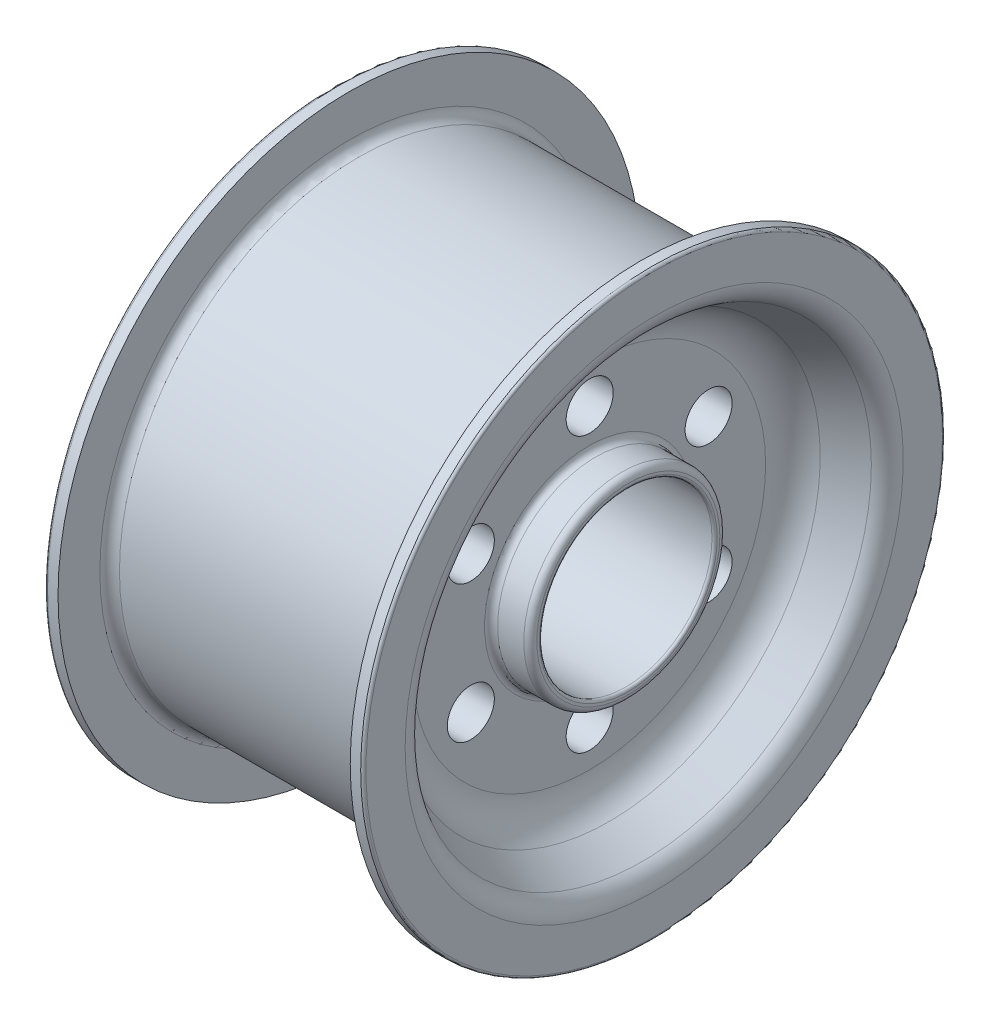
ISO-10303-21;
HEADER;
FILE_DESCRIPTION(('STEP AP214'),'2;1');
FILE_NAME('part.step','',(''),(''),'','','');
FILE_SCHEMA(('AUTOMOTIVE_DESIGN { 1 0 10303 214 1 1 1 1 }'));
ENDSEC;
DATA;
#1=APPLICATION_CONTEXT('core data for automotive mechanical design processes');
#2=APPLICATION_PROTOCOL_DEFINITION('international standard','automotive_design',2000,#1);
#3=PRODUCT_CONTEXT('',#1,'mechanical');
#4=PRODUCT('Part','Part','',(#3));
#5=PRODUCT_RELATED_PRODUCT_CATEGORY('part','',(#4));
#6=PRODUCT_DEFINITION_FORMATION('','',#4);
#7=PRODUCT_DEFINITION_CONTEXT('part definition',#1,'design');
#8=PRODUCT_DEFINITION('design','',#6,#7);
#9=PRODUCT_DEFINITION_SHAPE('','',#8);
#10=(LENGTH_UNIT() NAMED_UNIT(*) SI_UNIT(.MILLI.,.METRE.));
#11=(NAMED_UNIT(*) PLANE_ANGLE_UNIT() SI_UNIT($,.RADIAN.));
#12=(NAMED_UNIT(*) SI_UNIT($,.STERADIAN.) SOLID_ANGLE_UNIT());
#13=UNCERTAINTY_MEASURE_WITH_UNIT(LENGTH_MEASURE(1.E-05),#10,'distance_accuracy_value','');
#14=(GEOMETRIC_REPRESENTATION_CONTEXT(3) GLOBAL_UNCERTAINTY_ASSIGNED_CONTEXT((#13)) GLOBAL_UNIT_ASSIGNED_CONTEXT((#10,
#11,#12)) REPRESENTATION_CONTEXT('',''));
#15=CARTESIAN_POINT('',(0.,0.,0.));
#16=DIRECTION('',(0.,0.,1.));
#17=DIRECTION('',(1.,0.,0.));
#18=AXIS2_PLACEMENT_3D('',#15,#16,#17);
#19=CARTESIAN_POINT('',(111.78283122,0.00551797639763528,-0.00245203907636491));
#20=DIRECTION('',(-1.,0.,0.));
#21=DIRECTION('',(0.,0.,1.));
#22=AXIS2_PLACEMENT_3D('',#19,#20,#21);
#23=TOROIDAL_SURFACE('',#22,147.94786485,32.8773033);
#24=CARTESIAN_POINT('',(78.90552792,0.00551797639763528,-0.00245203907636491));
#25=DIRECTION('',(-1.,0.,0.));
#26=DIRECTION('',(0.,0.,1.));
#27=AXIS2_PLACEMENT_3D('',#24,#25,#26);
#28=CIRCLE('',#27,147.94786485);
#29=CARTESIAN_POINT('',(78.90552792,0.00551797639763528,147.945412810924));
#30=VERTEX_POINT('',#29);
#31=EDGE_CURVE('E129',#30,#30,#28,.T.);
#32=ORIENTED_EDGE('',*,*,#31,.T.);
#33=EDGE_LOOP('',(#32));
#34=FACE_BOUND('',#33,.T.);
#35=CARTESIAN_POINT('',(95.8977448214325,0.00551797639763528,-0.00245203907636491));
#36=DIRECTION('',(-1.,0.,0.));
#37=DIRECTION('',(0.,0.,1.));
#38=AXIS2_PLACEMENT_3D('',#35,#36,#37);
#39=CIRCLE('',#38,176.732949570915);
#40=CARTESIAN_POINT('',(95.8977448214325,0.00551797639763528,176.730497531838));
#41=VERTEX_POINT('',#40);
#42=EDGE_CURVE('E90',#41,#41,#39,.T.);
#43=ORIENTED_EDGE('',*,*,#42,.F.);
#44=EDGE_LOOP('',(#43));
#45=FACE_BOUND('',#44,.T.);
#46=ADVANCED_FACE('F34',(#34,#45),#23,.F.);
#47=CARTESIAN_POINT('',(123.525888467764,0.00551797639763528,-0.00245203907636491));
#48=DIRECTION('',(1.,0.,0.));
#49=DIRECTION('',(0.,0.,-1.));
#50=AXIS2_PLACEMENT_3D('',#47,#48,#49);
#51=CONICAL_SURFACE('',#50,191.979576534466,0.504263442618102);
#52=ORIENTED_EDGE('',*,*,#42,.T.);
#53=EDGE_LOOP('',(#52));
#54=FACE_BOUND('',#53,.T.);
#55=CARTESIAN_POINT('',(123.525888467764,0.00551797639763528,-0.00245203907636491));
#56=DIRECTION('',(-1.,0.,0.));
#57=DIRECTION('',(0.,0.,1.));
#58=AXIS2_PLACEMENT_3D('',#55,#56,#57);
#59=CIRCLE('',#58,191.979576534466);
#60=CARTESIAN_POINT('',(123.525888467764,0.00551797639763528,191.97712449539));
#61=VERTEX_POINT('',#60);
#62=EDGE_CURVE('E93',#61,#61,#59,.T.);
#63=ORIENTED_EDGE('',*,*,#62,.F.);
#64=EDGE_LOOP('',(#63));
#65=FACE_BOUND('',#64,.T.);
#66=ADVANCED_FACE('F193',(#54,#65),#51,.F.);
#67=CARTESIAN_POINT('',(114.2595880686,0.00551797639763528,-0.00245203907636491));
#68=DIRECTION('',(-1.,0.,0.));
#69=DIRECTION('',(0.,0.,1.));
#70=AXIS2_PLACEMENT_3D('',#67,#68,#69);
#71=TOROIDAL_SURFACE('',#70,208.770875955,19.1784269250001);
#72=ORIENTED_EDGE('',*,*,#62,.T.);
#73=EDGE_LOOP('',(#72));
#74=FACE_BOUND('',#73,.T.);
#75=CARTESIAN_POINT('',(133.4380149936,0.00551797639763528,-0.00245203907636491));
#76=DIRECTION('',(-1.,0.,0.));
#77=DIRECTION('',(0.,0.,1.));
#78=AXIS2_PLACEMENT_3D('',#75,#76,#77);
#79=CIRCLE('',#78,208.770875955);
#80=CARTESIAN_POINT('',(133.4380149936,0.00551797639763528,208.768423915924));
#81=VERTEX_POINT('',#80);
#82=EDGE_CURVE('E96',#81,#81,#79,.T.);
#83=ORIENTED_EDGE('',*,*,#82,.F.);
#84=EDGE_LOOP('',(#83));
#85=FACE_BOUND('',#84,.T.);
#86=ADVANCED_FACE('F199',(#74,#85),#71,.T.);
#87=CARTESIAN_POINT('',(133.4380149936,0.00551797639763528,-0.00245203907636491));
#88=DIRECTION('',(1.,0.,0.));
#89=DIRECTION('',(0.,0.,-1.));
#90=AXIS2_PLACEMENT_3D('',#87,#88,#89);
#91=PLANE('',#90);
#92=CARTESIAN_POINT('',(133.4380149936,0.00551797639763528,-0.00245203907636491));
#93=DIRECTION('',(1.,0.,0.));
#94=DIRECTION('',(0.,0.,-1.));
#95=AXIS2_PLACEMENT_3D('',#92,#93,#94);
#96=CIRCLE('',#95,241.648179255);
#97=CARTESIAN_POINT('',(133.4380149936,0.00551797639763528,-241.650631294076));
#98=VERTEX_POINT('',#97);
#99=EDGE_CURVE('E66',#98,#98,#96,.T.);
#100=ORIENTED_EDGE('',*,*,#99,.T.);
#101=EDGE_LOOP('',(#100));
#102=FACE_BOUND('',#101,.T.);
#103=ORIENTED_EDGE('',*,*,#82,.T.);
#104=EDGE_LOOP('',(#103));
#105=FACE_BOUND('',#104,.T.);
#106=ADVANCED_FACE('F205',(#102,#105),#91,.T.);
#107=CARTESIAN_POINT('',(0.,0.00551797639763528,-0.00245203907636491));
#108=DIRECTION('',(-1.,0.,0.));
#109=DIRECTION('',(0.,0.,1.));
#110=AXIS2_PLACEMENT_3D('',#107,#108,#109);
#111=CYLINDRICAL_SURFACE('',#110,243.839999475);
#112=CARTESIAN_POINT('',(131.2461947736,0.00551797639763528,-0.00245203907636491));
#113=DIRECTION('',(1.,0.,0.));
#114=DIRECTION('',(0.,0.,-1.));
#115=AXIS2_PLACEMENT_3D('',#112,#113,#114);
#116=CIRCLE('',#115,243.839999475);
#117=CARTESIAN_POINT('',(131.2461947736,0.00551797639763528,-243.842451514076));
#118=VERTEX_POINT('',#117);
#119=EDGE_CURVE('E69',#118,#118,#116,.F.);
#120=ORIENTED_EDGE('',*,*,#119,.T.);
#121=EDGE_LOOP('',(#120));
#122=FACE_BOUND('',#121,.T.);
#123=CARTESIAN_POINT('',(122.4789138936,0.00551797639763528,-0.00245203907636491));
#124=DIRECTION('',(-1.,0.,0.));
#125=DIRECTION('',(0.,0.,1.));
#126=AXIS2_PLACEMENT_3D('',#123,#124,#125);
#127=CIRCLE('',#126,243.839999475);
#128=CARTESIAN_POINT('',(122.4789138936,0.00551797639763528,243.837547435924));
#129=VERTEX_POINT('',#128);
#130=EDGE_CURVE('E99',#129,#129,#127,.T.);
#131=ORIENTED_EDGE('',*,*,#130,.F.);
#132=EDGE_LOOP('',(#131));
#133=FACE_BOUND('',#132,.T.);
#134=ADVANCED_FACE('F210',(#122,#133),#111,.T.);
#135=CARTESIAN_POINT('',(122.4789138936,0.00551797639721035,-0.00245203907636491));
#136=DIRECTION('',(1.,0.,0.));
#137=DIRECTION('',(0.,0.,-1.));
#138=AXIS2_PLACEMENT_3D('',#135,#136,#137);
#139=PLANE('',#138);
#140=CARTESIAN_POINT('',(122.4789138936,0.00551797639763528,-0.00245203907636491));
#141=DIRECTION('',(-1.,0.,0.));
#142=DIRECTION('',(0.,0.,1.));
#143=AXIS2_PLACEMENT_3D('',#140,#141,#142);
#144=CIRCLE('',#143,208.770875955);
#145=CARTESIAN_POINT('',(122.4789138936,0.00551797639763528,208.768423915924));
#146=VERTEX_POINT('',#145);
#147=EDGE_CURVE('E102',#146,#146,#144,.T.);
#148=ORIENTED_EDGE('',*,*,#147,.F.);
#149=EDGE_LOOP('',(#148));
#150=FACE_BOUND('',#149,.T.);
#151=ORIENTED_EDGE('',*,*,#130,.T.);
#152=EDGE_LOOP('',(#151));
#153=FACE_BOUND('',#152,.T.);
#154=ADVANCED_FACE('F216',(#150,#153),#139,.F.);
#155=CARTESIAN_POINT('',(114.2595880686,0.00551797639763528,-0.00245203907636491));
#156=DIRECTION('',(-1.,0.,0.));
#157=DIRECTION('',(0.,0.,1.));
#158=AXIS2_PLACEMENT_3D('',#155,#156,#157);
#159=TOROIDAL_SURFACE('',#158,208.770875955,8.21932582499995);
#160=CARTESIAN_POINT('',(114.2595880686,0.00551797639763528,-0.00245203907636491));
#161=DIRECTION('',(-1.,0.,0.));
#162=DIRECTION('',(0.,0.,1.));
#163=AXIS2_PLACEMENT_3D('',#160,#161,#162);
#164=CIRCLE('',#163,200.55155013);
#165=CARTESIAN_POINT('',(114.2595880686,0.00551797639763528,200.549098090924));
#166=VERTEX_POINT('',#165);
#167=EDGE_CURVE('E105',#166,#166,#164,.T.);
#168=ORIENTED_EDGE('',*,*,#167,.F.);
#169=EDGE_LOOP('',(#168));
#170=FACE_BOUND('',#169,.T.);
#171=ORIENTED_EDGE('',*,*,#147,.T.);
#172=EDGE_LOOP('',(#171));
#173=FACE_BOUND('',#172,.T.);
#174=ADVANCED_FACE('F307',(#170,#173),#159,.F.);
#175=CARTESIAN_POINT('',(0.,0.00551797639763528,-0.00245203907636491));
#176=DIRECTION('',(-1.,0.,0.));
#177=DIRECTION('',(0.,0.,1.));
#178=AXIS2_PLACEMENT_3D('',#175,#176,#177);
#179=CYLINDRICAL_SURFACE('',#178,200.55155013);
#180=ORIENTED_EDGE('',*,*,#167,.T.);
#181=EDGE_LOOP('',(#180));
#182=FACE_BOUND('',#181,.T.);
#183=CARTESIAN_POINT('',(-114.2595880686,0.00551797639763528,-0.00245203907636491));
#184=DIRECTION('',(-1.,0.,0.));
#185=DIRECTION('',(0.,0.,1.));
#186=AXIS2_PLACEMENT_3D('',#183,#184,#185);
#187=CIRCLE('',#186,200.55155013);
#188=CARTESIAN_POINT('',(-114.2595880686,0.00551797639763528,200.549098090924));
#189=VERTEX_POINT('',#188);
#190=EDGE_CURVE('E108',#189,#189,#187,.T.);
#191=ORIENTED_EDGE('',*,*,#190,.F.);
#192=EDGE_LOOP('',(#191));
#193=FACE_BOUND('',#192,.T.);
#194=ADVANCED_FACE('F303',(#182,#193),#179,.T.);
#195=CARTESIAN_POINT('',(-114.2595880686,0.00551797639763528,-0.00245203907636491));
#196=DIRECTION('',(-1.,0.,0.));
#197=DIRECTION('',(0.,0.,1.));
#198=AXIS2_PLACEMENT_3D('',#195,#196,#197);
#199=TOROIDAL_SURFACE('',#198,208.770875955,8.21932582499998);
#200=ORIENTED_EDGE('',*,*,#190,.T.);
#201=EDGE_LOOP('',(#200));
#202=FACE_BOUND('',#201,.T.);
#203=CARTESIAN_POINT('',(-122.4789138936,0.00551797639763528,-0.00245203907636491));
#204=DIRECTION('',(-1.,0.,0.));
#205=DIRECTION('',(0.,0.,1.));
#206=AXIS2_PLACEMENT_3D('',#203,#204,#205);
#207=CIRCLE('',#206,208.770875955);
#208=CARTESIAN_POINT('',(-122.4789138936,0.00551797639763528,208.768423915924));
#209=VERTEX_POINT('',#208);
#210=EDGE_CURVE('E111',#209,#209,#207,.T.);
#211=ORIENTED_EDGE('',*,*,#210,.F.);
#212=EDGE_LOOP('',(#211));
#213=FACE_BOUND('',#212,.T.);
#214=ADVANCED_FACE('F299',(#202,#213),#199,.F.);
#215=CARTESIAN_POINT('',(-122.4789138936,0.00551797639742282,-0.00245203907636491));
#216=DIRECTION('',(1.,0.,0.));
#217=DIRECTION('',(0.,0.,-1.));
#218=AXIS2_PLACEMENT_3D('',#215,#216,#217);
#219=PLANE('',#218);
#220=ORIENTED_EDGE('',*,*,#210,.T.);
#221=EDGE_LOOP('',(#220));
#222=FACE_BOUND('',#221,.T.);
#223=CARTESIAN_POINT('',(-122.4789138936,0.00551797639763528,-0.00245203907636491));
#224=DIRECTION('',(-1.,0.,0.));
#225=DIRECTION('',(0.,0.,1.));
#226=AXIS2_PLACEMENT_3D('',#223,#224,#225);
#227=CIRCLE('',#226,243.839999475);
#228=CARTESIAN_POINT('',(-122.4789138936,0.00551797639763528,243.837547435924));
#229=VERTEX_POINT('',#228);
#230=EDGE_CURVE('E114',#229,#229,#227,.T.);
#231=ORIENTED_EDGE('',*,*,#230,.F.);
#232=EDGE_LOOP('',(#231));
#233=FACE_BOUND('',#232,.T.);
#234=ADVANCED_FACE('F295',(#222,#233),#219,.T.);
#235=CARTESIAN_POINT('',(0.,0.00551797639763528,-0.00245203907636491));
#236=DIRECTION('',(-1.,0.,0.));
#237=DIRECTION('',(0.,0.,1.));
#238=AXIS2_PLACEMENT_3D('',#235,#236,#237);
#239=CYLINDRICAL_SURFACE('',#238,243.839999475);
#240=CARTESIAN_POINT('',(-131.2461947736,0.00551797639763528,-0.00245203907636491));
#241=DIRECTION('',(1.,0.,0.));
#242=DIRECTION('',(0.,0.,-1.));
#243=AXIS2_PLACEMENT_3D('',#240,#241,#242);
#244=CIRCLE('',#243,243.839999475);
#245=CARTESIAN_POINT('',(-131.2461947736,0.00551797639763528,-243.842451514076));
#246=VERTEX_POINT('',#245);
#247=EDGE_CURVE('E72',#246,#246,#244,.T.);
#248=ORIENTED_EDGE('',*,*,#247,.T.);
#249=EDGE_LOOP('',(#248));
#250=FACE_BOUND('',#249,.T.);
#251=ORIENTED_EDGE('',*,*,#230,.T.);
#252=EDGE_LOOP('',(#251));
#253=FACE_BOUND('',#252,.T.);
#254=ADVANCED_FACE('F291',(#250,#253),#239,.T.);
#255=CARTESIAN_POINT('',(-133.4380149936,0.00551797639763528,-0.00245203907636491));
#256=DIRECTION('',(1.,0.,0.));
#257=DIRECTION('',(0.,0.,-1.));
#258=AXIS2_PLACEMENT_3D('',#255,#256,#257);
#259=PLANE('',#258);
#260=CARTESIAN_POINT('',(-133.4380149936,0.00551797639763528,-0.00245203907636491));
#261=DIRECTION('',(1.,0.,0.));
#262=DIRECTION('',(0.,0.,-1.));
#263=AXIS2_PLACEMENT_3D('',#260,#261,#262);
#264=CIRCLE('',#263,241.648179255);
#265=CARTESIAN_POINT('',(-133.4380149936,0.00551797639763528,-241.650631294076));
#266=VERTEX_POINT('',#265);
#267=EDGE_CURVE('E75',#266,#266,#264,.F.);
#268=ORIENTED_EDGE('',*,*,#267,.T.);
#269=EDGE_LOOP('',(#268));
#270=FACE_BOUND('',#269,.T.);
#271=CARTESIAN_POINT('',(-133.4380149936,0.00551797639763528,-0.00245203907636491));
#272=DIRECTION('',(-1.,0.,0.));
#273=DIRECTION('',(0.,0.,1.));
#274=AXIS2_PLACEMENT_3D('',#271,#272,#273);
#275=CIRCLE('',#274,208.770875955);
#276=CARTESIAN_POINT('',(-133.4380149936,0.00551797639763528,208.768423915924));
#277=VERTEX_POINT('',#276);
#278=EDGE_CURVE('E117',#277,#277,#275,.T.);
#279=ORIENTED_EDGE('',*,*,#278,.F.);
#280=EDGE_LOOP('',(#279));
#281=FACE_BOUND('',#280,.T.);
#282=ADVANCED_FACE('F287',(#270,#281),#259,.F.);
#283=CARTESIAN_POINT('',(-114.2595880686,0.00551797639763528,-0.00245203907636491));
#284=DIRECTION('',(-1.,0.,0.));
#285=DIRECTION('',(0.,0.,1.));
#286=AXIS2_PLACEMENT_3D('',#283,#284,#285);
#287=TOROIDAL_SURFACE('',#286,208.770875955,19.1784269250001);
#288=CARTESIAN_POINT('',(-123.525888467764,0.00551797639763528,-0.00245203907636491));
#289=DIRECTION('',(-1.,0.,0.));
#290=DIRECTION('',(0.,0.,1.));
#291=AXIS2_PLACEMENT_3D('',#288,#289,#290);
#292=CIRCLE('',#291,191.979576534466);
#293=CARTESIAN_POINT('',(-123.525888467764,0.00551797639763528,191.97712449539));
#294=VERTEX_POINT('',#293);
#295=EDGE_CURVE('E120',#294,#294,#292,.T.);
#296=ORIENTED_EDGE('',*,*,#295,.F.);
#297=EDGE_LOOP('',(#296));
#298=FACE_BOUND('',#297,.T.);
#299=ORIENTED_EDGE('',*,*,#278,.T.);
#300=EDGE_LOOP('',(#299));
#301=FACE_BOUND('',#300,.T.);
#302=ADVANCED_FACE('F283',(#298,#301),#287,.T.);
#303=CARTESIAN_POINT('',(-123.525888467764,0.00551797639763528,-0.00245203907636491));
#304=DIRECTION('',(-1.,0.,0.));
#305=DIRECTION('',(0.,0.,1.));
#306=AXIS2_PLACEMENT_3D('',#303,#304,#305);
#307=CONICAL_SURFACE('',#306,191.979576534466,0.504263442618103);
#308=CARTESIAN_POINT('',(-95.8977448214324,0.00551797639763528,-0.00245203907636491));
#309=DIRECTION('',(-1.,0.,0.));
#310=DIRECTION('',(0.,0.,1.));
#311=AXIS2_PLACEMENT_3D('',#308,#309,#310);
#312=CIRCLE('',#311,176.732949570915);
#313=CARTESIAN_POINT('',(-95.8977448214324,0.00551797639763528,176.730497531838));
#314=VERTEX_POINT('',#313);
#315=EDGE_CURVE('E123',#314,#314,#312,.T.);
#316=ORIENTED_EDGE('',*,*,#315,.F.);
#317=EDGE_LOOP('',(#316));
#318=FACE_BOUND('',#317,.T.);
#319=ORIENTED_EDGE('',*,*,#295,.T.);
#320=EDGE_LOOP('',(#319));
#321=FACE_BOUND('',#320,.T.);
#322=ADVANCED_FACE('F279',(#318,#321),#307,.F.);
#323=CARTESIAN_POINT('',(-111.78283122,0.00551797639763528,-0.00245203907636491));
#324=DIRECTION('',(-1.,0.,0.));
#325=DIRECTION('',(0.,0.,1.));
#326=AXIS2_PLACEMENT_3D('',#323,#324,#325);
#327=TOROIDAL_SURFACE('',#326,147.94786485,32.8773033);
#328=CARTESIAN_POINT('',(-78.90552792,0.00551797639763528,-0.00245203907636491));
#329=DIRECTION('',(-1.,0.,0.));
#330=DIRECTION('',(0.,0.,1.));
#331=AXIS2_PLACEMENT_3D('',#328,#329,#330);
#332=CIRCLE('',#331,147.94786485);
#333=CARTESIAN_POINT('',(-78.90552792,0.00551797639763528,147.945412810924));
#334=VERTEX_POINT('',#333);
#335=EDGE_CURVE('E126',#334,#334,#332,.T.);
#336=ORIENTED_EDGE('',*,*,#335,.F.);
#337=EDGE_LOOP('',(#336));
#338=FACE_BOUND('',#337,.T.);
#339=ORIENTED_EDGE('',*,*,#315,.T.);
#340=EDGE_LOOP('',(#339));
#341=FACE_BOUND('',#340,.T.);
#342=ADVANCED_FACE('F275',(#338,#341),#327,.F.);
#343=CARTESIAN_POINT('',(-78.90552792,0.00551797639763528,-0.00245203907636491));
#344=DIRECTION('',(1.,0.,0.));
#345=DIRECTION('',(0.,0.,-1.));
#346=AXIS2_PLACEMENT_3D('',#343,#344,#345);
#347=PLANE('',#346);
#348=CARTESIAN_POINT('',(-78.90552792,0.00551797639763528,-0.00245203907636491));
#349=DIRECTION('',(1.,0.,0.));
#350=DIRECTION('',(0.,0.,-1.));
#351=AXIS2_PLACEMENT_3D('',#348,#349,#350);
#352=CIRCLE('',#351,87.6728088);
#353=CARTESIAN_POINT('',(-78.90552792,0.00551797639763528,-87.6752608390764));
#354=VERTEX_POINT('',#353);
#355=EDGE_CURVE('E57',#354,#354,#352,.T.);
#356=ORIENTED_EDGE('',*,*,#355,.T.);
#357=EDGE_LOOP('',(#356));
#358=FACE_BOUND('',#357,.T.);
#359=CARTESIAN_POINT('',(-78.90552792,116.181439267868,-0.493643933381996));
#360=DIRECTION('',(1.,0.,0.));
#361=DIRECTION('',(0.,0.,-1.));
#362=AXIS2_PLACEMENT_3D('',#359,#360,#361);
#363=CIRCLE('',#362,19.72638198);
#364=CARTESIAN_POINT('',(-78.90552792,116.181439267868,-20.220025913382));
#365=VERTEX_POINT('',#364);
#366=EDGE_CURVE('E132',#365,#365,#363,.T.);
#367=ORIENTED_EDGE('',*,*,#366,.T.);
#368=EDGE_LOOP('',(#367));
#369=FACE_BOUND('',#368,.T.);
#370=CARTESIAN_POINT('',(-78.90552792,58.6461584928629,99.1603855966558));
#371=DIRECTION('',(1.,0.,0.));
#372=DIRECTION('',(0.,0.,-1.));
#373=AXIS2_PLACEMENT_3D('',#370,#371,#372);
#374=CIRCLE('',#373,19.72638198);
#375=CARTESIAN_POINT('',(-78.90552792,58.6461584928629,79.4340036166558));
#376=VERTEX_POINT('',#375);
#377=EDGE_CURVE('E135',#376,#376,#374,.T.);
#378=ORIENTED_EDGE('',*,*,#377,.T.);
#379=EDGE_LOOP('',(#378));
#380=FACE_BOUND('',#379,.T.);
#381=CARTESIAN_POINT('',(-78.90552792,-56.4244030571371,99.1603855966495));
#382=DIRECTION('',(1.,0.,0.));
#383=DIRECTION('',(0.,0.,-1.));
#384=AXIS2_PLACEMENT_3D('',#381,#382,#383);
#385=CIRCLE('',#384,19.72638198);
#386=CARTESIAN_POINT('',(-78.90552792,-56.4244030571371,79.4340036166494));
#387=VERTEX_POINT('',#386);
#388=EDGE_CURVE('E138',#387,#387,#385,.T.);
#389=ORIENTED_EDGE('',*,*,#388,.T.);
#390=EDGE_LOOP('',(#389));
#391=FACE_BOUND('',#390,.T.);
#392=CARTESIAN_POINT('',(-78.90552792,-113.959683832132,-0.493643933394407));
#393=DIRECTION('',(1.,0.,0.));
#394=DIRECTION('',(0.,0.,-1.));
#395=AXIS2_PLACEMENT_3D('',#392,#393,#394);
#396=CIRCLE('',#395,19.72638198);
#397=CARTESIAN_POINT('',(-78.90552792,-113.959683832132,-20.2200259133944));
#398=VERTEX_POINT('',#397);
#399=EDGE_CURVE('E141',#398,#398,#396,.T.);
#400=ORIENTED_EDGE('',*,*,#399,.T.);
#401=EDGE_LOOP('',(#400));
#402=FACE_BOUND('',#401,.T.);
#403=CARTESIAN_POINT('',(-78.90552792,-56.4244030571262,-100.147673463432));
#404=DIRECTION('',(1.,0.,0.));
#405=DIRECTION('',(0.,0.,-1.));
#406=AXIS2_PLACEMENT_3D('',#403,#404,#405);
#407=CIRCLE('',#406,19.72638198);
#408=CARTESIAN_POINT('',(-78.90552792,-56.4244030571262,-119.874055443432));
#409=VERTEX_POINT('',#408);
#410=EDGE_CURVE('E144',#409,#409,#407,.T.);
#411=ORIENTED_EDGE('',*,*,#410,.T.);
#412=EDGE_LOOP('',(#411));
#413=FACE_BOUND('',#412,.T.);
#414=CARTESIAN_POINT('',(-78.90552792,58.6461584928738,-100.147673463426));
#415=DIRECTION('',(1.,0.,0.));
#416=DIRECTION('',(0.,0.,-1.));
#417=AXIS2_PLACEMENT_3D('',#414,#415,#416);
#418=CIRCLE('',#417,19.7263819800001);
#419=CARTESIAN_POINT('',(-78.90552792,58.6461584928738,-119.874055443426));
#420=VERTEX_POINT('',#419);
#421=EDGE_CURVE('E147',#420,#420,#418,.T.);
#422=ORIENTED_EDGE('',*,*,#421,.T.);
#423=EDGE_LOOP('',(#422));
#424=FACE_BOUND('',#423,.T.);
#425=ORIENTED_EDGE('',*,*,#335,.T.);
#426=EDGE_LOOP('',(#425));
#427=FACE_BOUND('',#426,.T.);
#428=ADVANCED_FACE('F268',(#358,#369,#380,#391,#402,#413,#424,#427),#347,.F.);
#429=CARTESIAN_POINT('',(0.,0.00551797639763528,-0.00245203907636491));
#430=DIRECTION('',(-1.,0.,0.));
#431=DIRECTION('',(0.,0.,1.));
#432=AXIS2_PLACEMENT_3D('',#429,#430,#431);
#433=CYLINDRICAL_SURFACE('',#432,82.19325825);
#434=CARTESIAN_POINT('',(-84.38507847,0.00551797639763528,-0.00245203907636491));
#435=DIRECTION('',(1.,0.,0.));
#436=DIRECTION('',(0.,0.,-1.));
#437=AXIS2_PLACEMENT_3D('',#434,#435,#436);
#438=CIRCLE('',#437,82.19325825);
#439=CARTESIAN_POINT('',(-84.38507847,0.00551797639763528,-82.1957102890764));
#440=VERTEX_POINT('',#439);
#441=EDGE_CURVE('E60',#440,#440,#438,.F.);
#442=ORIENTED_EDGE('',*,*,#441,.T.);
#443=EDGE_LOOP('',(#442));
#444=FACE_BOUND('',#443,.T.);
#445=CARTESIAN_POINT('',(-106.30328067,0.00551797639763528,-0.00245203907636491));
#446=DIRECTION('',(1.,0.,0.));
#447=DIRECTION('',(0.,0.,-1.));
#448=AXIS2_PLACEMENT_3D('',#445,#446,#447);
#449=CIRCLE('',#448,82.19325825);
#450=CARTESIAN_POINT('',(-106.30328067,0.00551797639763528,-82.1957102890764));
#451=VERTEX_POINT('',#450);
#452=EDGE_CURVE('E63',#451,#451,#449,.T.);
#453=ORIENTED_EDGE('',*,*,#452,.T.);
#454=EDGE_LOOP('',(#453));
#455=FACE_BOUND('',#454,.T.);
#456=ADVANCED_FACE('F259',(#444,#455),#433,.T.);
#457=CARTESIAN_POINT('',(-111.78283122,0.00551797639755255,-0.00245203907636491));
#458=DIRECTION('',(1.,0.,0.));
#459=DIRECTION('',(0.,0.,-1.));
#460=AXIS2_PLACEMENT_3D('',#457,#458,#459);
#461=PLANE('',#460);
#462=CARTESIAN_POINT('',(-111.78283122,0.00551797639763528,-0.00245203907636491));
#463=DIRECTION('',(1.,0.,0.));
#464=DIRECTION('',(0.,0.,-1.));
#465=AXIS2_PLACEMENT_3D('',#462,#463,#464);
#466=CIRCLE('',#465,74.52188748);
#467=CARTESIAN_POINT('',(-111.78283122,0.00551797639763528,-74.5243395190764));
#468=VERTEX_POINT('',#467);
#469=EDGE_CURVE('E49',#468,#468,#466,.T.);
#470=ORIENTED_EDGE('',*,*,#469,.T.);
#471=EDGE_LOOP('',(#470));
#472=FACE_BOUND('',#471,.T.);
#473=CARTESIAN_POINT('',(-111.78283122,0.00551797639763528,-0.00245203907636491));
#474=DIRECTION('',(1.,0.,0.));
#475=DIRECTION('',(0.,0.,-1.));
#476=AXIS2_PLACEMENT_3D('',#473,#474,#475);
#477=CIRCLE('',#476,76.7137077);
#478=CARTESIAN_POINT('',(-111.78283122,0.00551797639763528,-76.7161597390764));
#479=VERTEX_POINT('',#478);
#480=EDGE_CURVE('E54',#479,#479,#477,.F.);
#481=ORIENTED_EDGE('',*,*,#480,.T.);
#482=EDGE_LOOP('',(#481));
#483=FACE_BOUND('',#482,.T.);
#484=ADVANCED_FACE('F255',(#472,#483),#461,.F.);
#485=CARTESIAN_POINT('',(111.78283122,0.00551797639746981,-0.00245203907636491));
#486=DIRECTION('',(1.,0.,0.));
#487=DIRECTION('',(0.,0.,-1.));
#488=AXIS2_PLACEMENT_3D('',#485,#486,#487);
#489=PLANE('',#488);
#490=CARTESIAN_POINT('',(111.78283122,0.00551797639763528,-0.00245203907636491));
#491=DIRECTION('',(1.,0.,0.));
#492=DIRECTION('',(0.,0.,-1.));
#493=AXIS2_PLACEMENT_3D('',#490,#491,#492);
#494=CIRCLE('',#493,74.52188748);
#495=CARTESIAN_POINT('',(111.78283122,0.00551797639763528,-74.5243395190764));
#496=VERTEX_POINT('',#495);
#497=EDGE_CURVE('E10',#496,#496,#494,.F.);
#498=ORIENTED_EDGE('',*,*,#497,.T.);
#499=EDGE_LOOP('',(#498));
#500=FACE_BOUND('',#499,.T.);
#501=CARTESIAN_POINT('',(111.78283122,0.00551797639763528,-0.00245203907636491));
#502=DIRECTION('',(1.,0.,0.));
#503=DIRECTION('',(0.,0.,-1.));
#504=AXIS2_PLACEMENT_3D('',#501,#502,#503);
#505=CIRCLE('',#504,76.7137077);
#506=CARTESIAN_POINT('',(111.78283122,0.00551797639763528,-76.7161597390764));
#507=VERTEX_POINT('',#506);
#508=EDGE_CURVE('E81',#507,#507,#505,.T.);
#509=ORIENTED_EDGE('',*,*,#508,.T.);
#510=EDGE_LOOP('',(#509));
#511=FACE_BOUND('',#510,.T.);
#512=ADVANCED_FACE('F258',(#500,#511),#489,.T.);
#513=CARTESIAN_POINT('',(0.,0.00551797639763528,-0.00245203907636491));
#514=DIRECTION('',(-1.,0.,0.));
#515=DIRECTION('',(0.,0.,1.));
#516=AXIS2_PLACEMENT_3D('',#513,#514,#515);
#517=CYLINDRICAL_SURFACE('',#516,82.19325825);
#518=CARTESIAN_POINT('',(106.30328067,0.00551797639763528,-0.00245203907636491));
#519=DIRECTION('',(1.,0.,0.));
#520=DIRECTION('',(0.,0.,-1.));
#521=AXIS2_PLACEMENT_3D('',#518,#519,#520);
#522=CIRCLE('',#521,82.19325825);
#523=CARTESIAN_POINT('',(106.30328067,0.00551797639763528,-82.1957102890764));
#524=VERTEX_POINT('',#523);
#525=EDGE_CURVE('E84',#524,#524,#522,.F.);
#526=ORIENTED_EDGE('',*,*,#525,.T.);
#527=EDGE_LOOP('',(#526));
#528=FACE_BOUND('',#527,.T.);
#529=CARTESIAN_POINT('',(84.38507847,0.00551797639763528,-0.00245203907636491));
#530=DIRECTION('',(1.,0.,0.));
#531=DIRECTION('',(0.,0.,-1.));
#532=AXIS2_PLACEMENT_3D('',#529,#530,#531);
#533=CIRCLE('',#532,82.19325825);
#534=CARTESIAN_POINT('',(84.38507847,0.00551797639763528,-82.1957102890764));
#535=VERTEX_POINT('',#534);
#536=EDGE_CURVE('E87',#535,#535,#533,.T.);
#537=ORIENTED_EDGE('',*,*,#536,.T.);
#538=EDGE_LOOP('',(#537));
#539=FACE_BOUND('',#538,.T.);
#540=ADVANCED_FACE('F176',(#528,#539),#517,.T.);
#541=CARTESIAN_POINT('',(78.90552792,0.00551797639763528,-0.00245203907636491));
#542=DIRECTION('',(1.,0.,0.));
#543=DIRECTION('',(0.,0.,-1.));
#544=AXIS2_PLACEMENT_3D('',#541,#542,#543);
#545=PLANE('',#544);
#546=CARTESIAN_POINT('',(78.90552792,0.00551797639763528,-0.00245203907636491));
#547=DIRECTION('',(1.,0.,0.));
#548=DIRECTION('',(0.,0.,-1.));
#549=AXIS2_PLACEMENT_3D('',#546,#547,#548);
#550=CIRCLE('',#549,87.6728088);
#551=CARTESIAN_POINT('',(78.90552792,0.00551797639763528,-87.6752608390764));
#552=VERTEX_POINT('',#551);
#553=EDGE_CURVE('E78',#552,#552,#550,.F.);
#554=ORIENTED_EDGE('',*,*,#553,.T.);
#555=EDGE_LOOP('',(#554));
#556=FACE_BOUND('',#555,.T.);
#557=CARTESIAN_POINT('',(78.90552792,116.181439267868,-0.493643933381996));
#558=DIRECTION('',(1.,0.,0.));
#559=DIRECTION('',(0.,0.,-1.));
#560=AXIS2_PLACEMENT_3D('',#557,#558,#559);
#561=CIRCLE('',#560,19.72638198);
#562=CARTESIAN_POINT('',(78.90552792,116.181439267868,-20.220025913382));
#563=VERTEX_POINT('',#562);
#564=EDGE_CURVE('E150',#563,#563,#561,.T.);
#565=ORIENTED_EDGE('',*,*,#564,.F.);
#566=EDGE_LOOP('',(#565));
#567=FACE_BOUND('',#566,.T.);
#568=CARTESIAN_POINT('',(78.90552792,58.6461584928629,99.1603855966558));
#569=DIRECTION('',(1.,0.,0.));
#570=DIRECTION('',(0.,0.,-1.));
#571=AXIS2_PLACEMENT_3D('',#568,#569,#570);
#572=CIRCLE('',#571,19.72638198);
#573=CARTESIAN_POINT('',(78.90552792,58.6461584928629,79.4340036166558));
#574=VERTEX_POINT('',#573);
#575=EDGE_CURVE('E155',#574,#574,#572,.T.);
#576=ORIENTED_EDGE('',*,*,#575,.F.);
#577=EDGE_LOOP('',(#576));
#578=FACE_BOUND('',#577,.T.);
#579=CARTESIAN_POINT('',(78.90552792,-56.4244030571371,99.1603855966495));
#580=DIRECTION('',(1.,0.,0.));
#581=DIRECTION('',(0.,0.,-1.));
#582=AXIS2_PLACEMENT_3D('',#579,#580,#581);
#583=CIRCLE('',#582,19.72638198);
#584=CARTESIAN_POINT('',(78.90552792,-56.4244030571371,79.4340036166494));
#585=VERTEX_POINT('',#584);
#586=EDGE_CURVE('E151',#585,#585,#583,.T.);
#587=ORIENTED_EDGE('',*,*,#586,.F.);
#588=EDGE_LOOP('',(#587));
#589=FACE_BOUND('',#588,.T.);
#590=CARTESIAN_POINT('',(78.90552792,-113.959683832132,-0.493643933394407));
#591=DIRECTION('',(1.,0.,0.));
#592=DIRECTION('',(0.,0.,-1.));
#593=AXIS2_PLACEMENT_3D('',#590,#591,#592);
#594=CIRCLE('',#593,19.72638198);
#595=CARTESIAN_POINT('',(78.90552792,-113.959683832132,-20.2200259133944));
#596=VERTEX_POINT('',#595);
#597=EDGE_CURVE('E154',#596,#596,#594,.T.);
#598=ORIENTED_EDGE('',*,*,#597,.F.);
#599=EDGE_LOOP('',(#598));
#600=FACE_BOUND('',#599,.T.);
#601=CARTESIAN_POINT('',(78.90552792,-56.4244030571262,-100.147673463432));
#602=DIRECTION('',(1.,0.,0.));
#603=DIRECTION('',(0.,0.,-1.));
#604=AXIS2_PLACEMENT_3D('',#601,#602,#603);
#605=CIRCLE('',#604,19.72638198);
#606=CARTESIAN_POINT('',(78.90552792,-56.4244030571262,-119.874055443432));
#607=VERTEX_POINT('',#606);
#608=EDGE_CURVE('E158',#607,#607,#605,.T.);
#609=ORIENTED_EDGE('',*,*,#608,.F.);
#610=EDGE_LOOP('',(#609));
#611=FACE_BOUND('',#610,.T.);
#612=CARTESIAN_POINT('',(78.90552792,58.6461584928738,-100.147673463426));
#613=DIRECTION('',(1.,0.,0.));
#614=DIRECTION('',(0.,0.,-1.));
#615=AXIS2_PLACEMENT_3D('',#612,#613,#614);
#616=CIRCLE('',#615,19.7263819800001);
#617=CARTESIAN_POINT('',(78.90552792,58.6461584928738,-119.874055443426));
#618=VERTEX_POINT('',#617);
#619=EDGE_CURVE('E161',#618,#618,#616,.T.);
#620=ORIENTED_EDGE('',*,*,#619,.F.);
#621=EDGE_LOOP('',(#620));
#622=FACE_BOUND('',#621,.T.);
#623=ORIENTED_EDGE('',*,*,#31,.F.);
#624=EDGE_LOOP('',(#623));
#625=FACE_BOUND('',#624,.T.);
#626=ADVANCED_FACE('F172',(#556,#567,#578,#589,#600,#611,#622,#625),#545,.T.);
#627=CARTESIAN_POINT('',(-133.4380149936,58.6461584928738,-100.147673463426));
#628=DIRECTION('',(1.,0.,0.));
#629=DIRECTION('',(0.,0.,-1.));
#630=AXIS2_PLACEMENT_3D('',#627,#628,#629);
#631=CYLINDRICAL_SURFACE('',#630,19.7263819800001);
#632=ORIENTED_EDGE('',*,*,#619,.T.);
#633=EDGE_LOOP('',(#632));
#634=FACE_BOUND('',#633,.T.);
#635=ORIENTED_EDGE('',*,*,#421,.F.);
#636=EDGE_LOOP('',(#635));
#637=FACE_BOUND('',#636,.T.);
#638=ADVANCED_FACE('F175',(#634,#637),#631,.F.);
#639=CARTESIAN_POINT('',(-133.4380149936,-56.4244030571262,-100.147673463432));
#640=DIRECTION('',(1.,0.,0.));
#641=DIRECTION('',(0.,0.,-1.));
#642=AXIS2_PLACEMENT_3D('',#639,#640,#641);
#643=CYLINDRICAL_SURFACE('',#642,19.72638198);
#644=ORIENTED_EDGE('',*,*,#608,.T.);
#645=EDGE_LOOP('',(#644));
#646=FACE_BOUND('',#645,.T.);
#647=ORIENTED_EDGE('',*,*,#410,.F.);
#648=EDGE_LOOP('',(#647));
#649=FACE_BOUND('',#648,.T.);
#650=ADVANCED_FACE('F399',(#646,#649),#643,.F.);
#651=CARTESIAN_POINT('',(-133.4380149936,-113.959683832132,-0.493643933394407));
#652=DIRECTION('',(1.,0.,0.));
#653=DIRECTION('',(0.,0.,-1.));
#654=AXIS2_PLACEMENT_3D('',#651,#652,#653);
#655=CYLINDRICAL_SURFACE('',#654,19.72638198);
#656=ORIENTED_EDGE('',*,*,#597,.T.);
#657=EDGE_LOOP('',(#656));
#658=FACE_BOUND('',#657,.T.);
#659=ORIENTED_EDGE('',*,*,#399,.F.);
#660=EDGE_LOOP('',(#659));
#661=FACE_BOUND('',#660,.T.);
#662=ADVANCED_FACE('F409',(#658,#661),#655,.F.);
#663=CARTESIAN_POINT('',(-133.4380149936,-56.4244030571371,99.1603855966495));
#664=DIRECTION('',(1.,0.,0.));
#665=DIRECTION('',(0.,0.,-1.));
#666=AXIS2_PLACEMENT_3D('',#663,#664,#665);
#667=CYLINDRICAL_SURFACE('',#666,19.72638198);
#668=ORIENTED_EDGE('',*,*,#586,.T.);
#669=EDGE_LOOP('',(#668));
#670=FACE_BOUND('',#669,.T.);
#671=ORIENTED_EDGE('',*,*,#388,.F.);
#672=EDGE_LOOP('',(#671));
#673=FACE_BOUND('',#672,.T.);
#674=ADVANCED_FACE('F419',(#670,#673),#667,.F.);
#675=CARTESIAN_POINT('',(-133.4380149936,58.6461584928629,99.1603855966558));
#676=DIRECTION('',(1.,0.,0.));
#677=DIRECTION('',(0.,0.,-1.));
#678=AXIS2_PLACEMENT_3D('',#675,#676,#677);
#679=CYLINDRICAL_SURFACE('',#678,19.72638198);
#680=ORIENTED_EDGE('',*,*,#575,.T.);
#681=EDGE_LOOP('',(#680));
#682=FACE_BOUND('',#681,.T.);
#683=ORIENTED_EDGE('',*,*,#377,.F.);
#684=EDGE_LOOP('',(#683));
#685=FACE_BOUND('',#684,.T.);
#686=ADVANCED_FACE('F429',(#682,#685),#679,.F.);
#687=CARTESIAN_POINT('',(-133.4380149936,116.181439267868,-0.493643933381996));
#688=DIRECTION('',(1.,0.,0.));
#689=DIRECTION('',(0.,0.,-1.));
#690=AXIS2_PLACEMENT_3D('',#687,#688,#689);
#691=CYLINDRICAL_SURFACE('',#690,19.72638198);
#692=ORIENTED_EDGE('',*,*,#564,.T.);
#693=EDGE_LOOP('',(#692));
#694=FACE_BOUND('',#693,.T.);
#695=ORIENTED_EDGE('',*,*,#366,.F.);
#696=EDGE_LOOP('',(#695));
#697=FACE_BOUND('',#696,.T.);
#698=ADVANCED_FACE('F169',(#694,#697),#691,.F.);
#699=CARTESIAN_POINT('',(-133.4380149936,0.00551797639763528,-0.00245203907636491));
#700=DIRECTION('',(1.,0.,0.));
#701=DIRECTION('',(0.,0.,-1.));
#702=AXIS2_PLACEMENT_3D('',#699,#700,#701);
#703=CYLINDRICAL_SURFACE('',#702,72.33006726);
#704=CARTESIAN_POINT('',(-109.591011,0.00551797639763528,-0.00245203907636491));
#705=DIRECTION('',(1.,0.,0.));
#706=DIRECTION('',(0.,0.,-1.));
#707=AXIS2_PLACEMENT_3D('',#704,#705,#706);
#708=CIRCLE('',#707,72.33006726);
#709=CARTESIAN_POINT('',(-109.591011,0.00551797639763528,-72.3325192990764));
#710=VERTEX_POINT('',#709);
#711=EDGE_CURVE('E41',#710,#710,#708,.F.);
#712=ORIENTED_EDGE('',*,*,#711,.T.);
#713=EDGE_LOOP('',(#712));
#714=FACE_BOUND('',#713,.T.);
#715=CARTESIAN_POINT('',(109.591011,0.00551797639763528,-0.00245203907636491));
#716=DIRECTION('',(1.,0.,0.));
#717=DIRECTION('',(0.,0.,-1.));
#718=AXIS2_PLACEMENT_3D('',#715,#716,#717);
#719=CIRCLE('',#718,72.33006726);
#720=CARTESIAN_POINT('',(109.591011,0.00551797639763528,-72.3325192990764));
#721=VERTEX_POINT('',#720);
#722=EDGE_CURVE('E45',#721,#721,#719,.T.);
#723=ORIENTED_EDGE('',*,*,#722,.T.);
#724=EDGE_LOOP('',(#723));
#725=FACE_BOUND('',#724,.T.);
#726=ADVANCED_FACE('F225',(#714,#725),#703,.F.);
#727=CARTESIAN_POINT('',(106.30328067,0.00551797639763528,-0.00245203907636491));
#728=DIRECTION('',(1.,0.,0.));
#729=DIRECTION('',(0.,0.,-1.));
#730=AXIS2_PLACEMENT_3D('',#727,#728,#729);
#731=TOROIDAL_SURFACE('',#730,76.7137077,5.47955055);
#732=ORIENTED_EDGE('',*,*,#508,.F.);
#733=EDGE_LOOP('',(#732));
#734=FACE_BOUND('',#733,.T.);
#735=ORIENTED_EDGE('',*,*,#525,.F.);
#736=EDGE_LOOP('',(#735));
#737=FACE_BOUND('',#736,.T.);
#738=ADVANCED_FACE('F221',(#734,#737),#731,.T.);
#739=CARTESIAN_POINT('',(84.38507847,0.00551797639763528,-0.00245203907636491));
#740=DIRECTION('',(1.,0.,0.));
#741=DIRECTION('',(0.,0.,-1.));
#742=AXIS2_PLACEMENT_3D('',#739,#740,#741);
#743=TOROIDAL_SURFACE('',#742,87.6728088,5.47955055);
#744=ORIENTED_EDGE('',*,*,#536,.F.);
#745=EDGE_LOOP('',(#744));
#746=FACE_BOUND('',#745,.T.);
#747=ORIENTED_EDGE('',*,*,#553,.F.);
#748=EDGE_LOOP('',(#747));
#749=FACE_BOUND('',#748,.T.);
#750=ADVANCED_FACE('F224',(#746,#749),#743,.F.);
#751=CARTESIAN_POINT('',(-131.2461947736,0.00551797639763528,-0.00245203907636491));
#752=DIRECTION('',(1.,0.,0.));
#753=DIRECTION('',(0.,0.,-1.));
#754=AXIS2_PLACEMENT_3D('',#751,#752,#753);
#755=TOROIDAL_SURFACE('',#754,241.648179255,2.19182022);
#756=ORIENTED_EDGE('',*,*,#247,.F.);
#757=EDGE_LOOP('',(#756));
#758=FACE_BOUND('',#757,.T.);
#759=ORIENTED_EDGE('',*,*,#267,.F.);
#760=EDGE_LOOP('',(#759));
#761=FACE_BOUND('',#760,.T.);
#762=ADVANCED_FACE('F229',(#758,#761),#755,.T.);
#763=CARTESIAN_POINT('',(131.2461947736,0.00551797639763528,-0.00245203907636491));
#764=DIRECTION('',(1.,0.,0.));
#765=DIRECTION('',(0.,0.,-1.));
#766=AXIS2_PLACEMENT_3D('',#763,#764,#765);
#767=TOROIDAL_SURFACE('',#766,241.648179255,2.19182022);
#768=ORIENTED_EDGE('',*,*,#99,.F.);
#769=EDGE_LOOP('',(#768));
#770=FACE_BOUND('',#769,.T.);
#771=ORIENTED_EDGE('',*,*,#119,.F.);
#772=EDGE_LOOP('',(#771));
#773=FACE_BOUND('',#772,.T.);
#774=ADVANCED_FACE('F233',(#770,#773),#767,.T.);
#775=CARTESIAN_POINT('',(-84.38507847,0.00551797639763528,-0.00245203907636491));
#776=DIRECTION('',(1.,0.,0.));
#777=DIRECTION('',(0.,0.,-1.));
#778=AXIS2_PLACEMENT_3D('',#775,#776,#777);
#779=TOROIDAL_SURFACE('',#778,87.6728088,5.47955055);
#780=ORIENTED_EDGE('',*,*,#355,.F.);
#781=EDGE_LOOP('',(#780));
#782=FACE_BOUND('',#781,.T.);
#783=ORIENTED_EDGE('',*,*,#441,.F.);
#784=EDGE_LOOP('',(#783));
#785=FACE_BOUND('',#784,.T.);
#786=ADVANCED_FACE('F237',(#782,#785),#779,.F.);
#787=CARTESIAN_POINT('',(-106.30328067,0.00551797639763528,-0.00245203907636491));
#788=DIRECTION('',(1.,0.,0.));
#789=DIRECTION('',(0.,0.,-1.));
#790=AXIS2_PLACEMENT_3D('',#787,#788,#789);
#791=TOROIDAL_SURFACE('',#790,76.7137077,5.47955055);
#792=ORIENTED_EDGE('',*,*,#452,.F.);
#793=EDGE_LOOP('',(#792));
#794=FACE_BOUND('',#793,.T.);
#795=ORIENTED_EDGE('',*,*,#480,.F.);
#796=EDGE_LOOP('',(#795));
#797=FACE_BOUND('',#796,.T.);
#798=ADVANCED_FACE('F241',(#794,#797),#791,.T.);
#799=CARTESIAN_POINT('',(-109.591011,0.00551797639763528,-0.00245203907636491));
#800=DIRECTION('',(1.,0.,0.));
#801=DIRECTION('',(0.,0.,-1.));
#802=AXIS2_PLACEMENT_3D('',#799,#800,#801);
#803=TOROIDAL_SURFACE('',#802,74.52188748,2.19182022);
#804=ORIENTED_EDGE('',*,*,#711,.F.);
#805=EDGE_LOOP('',(#804));
#806=FACE_BOUND('',#805,.T.);
#807=ORIENTED_EDGE('',*,*,#469,.F.);
#808=EDGE_LOOP('',(#807));
#809=FACE_BOUND('',#808,.T.);
#810=ADVANCED_FACE('F244',(#806,#809),#803,.T.);
#811=CARTESIAN_POINT('',(109.591011,0.00551797639763528,-0.00245203907636491));
#812=DIRECTION('',(1.,0.,0.));
#813=DIRECTION('',(0.,0.,-1.));
#814=AXIS2_PLACEMENT_3D('',#811,#812,#813);
#815=TOROIDAL_SURFACE('',#814,74.52188748,2.19182022);
#816=ORIENTED_EDGE('',*,*,#497,.F.);
#817=EDGE_LOOP('',(#816));
#818=FACE_BOUND('',#817,.T.);
#819=ORIENTED_EDGE('',*,*,#722,.F.);
#820=EDGE_LOOP('',(#819));
#821=FACE_BOUND('',#820,.T.);
#822=ADVANCED_FACE('F36',(#818,#821),#815,.T.);
#823=CLOSED_SHELL('',(#46,#66,#86,#106,#134,#154,#174,#194,#214,#234,#254,#282,#302,#322,#342,
#428,#456,#484,#512,#540,#626,#638,#650,#662,#674,#686,#698,#726,#738,#750,#762,#774,#786,#798,
#810,#822));
#824=MANIFOLD_SOLID_BREP('B2',#823);
#825=ADVANCED_BREP_SHAPE_REPRESENTATION('',(#18,#824),#14);
#826=SHAPE_DEFINITION_REPRESENTATION(#9,#825);
ENDSEC;
END-ISO-10303-21;
